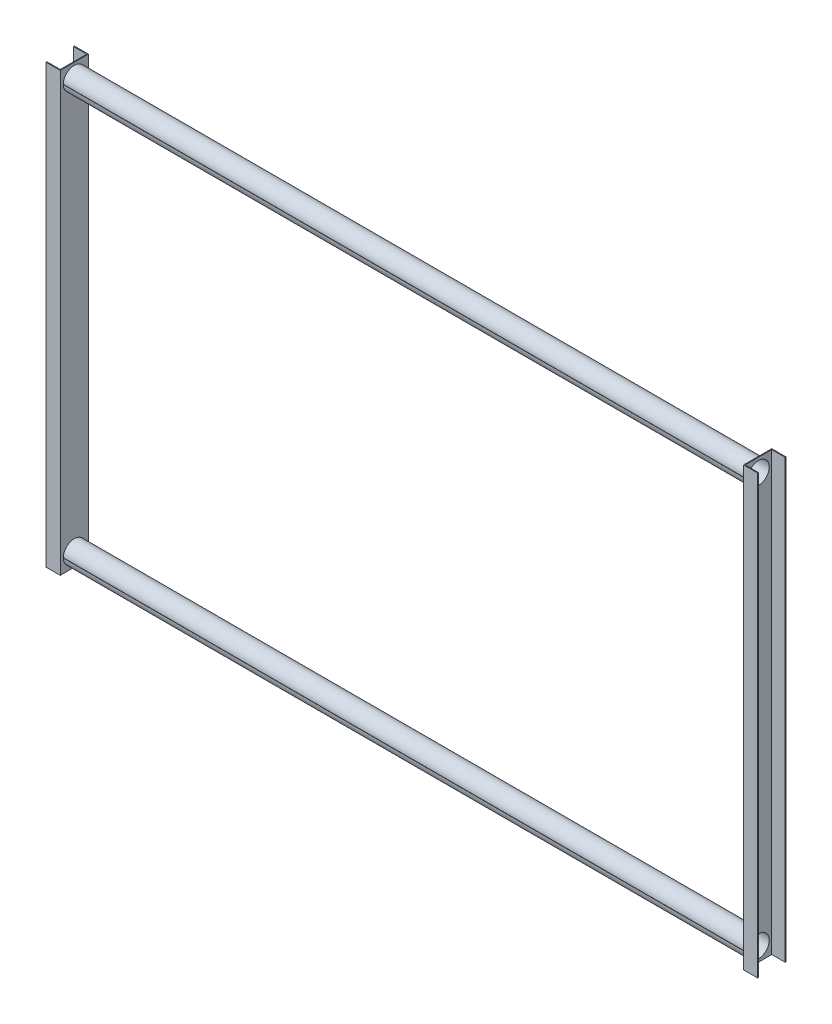
ISO-10303-21;
HEADER;
FILE_DESCRIPTION(('STEP AP214'),'2;1');
FILE_NAME('part.step','',(''),(''),'','','');
FILE_SCHEMA(('AUTOMOTIVE_DESIGN { 1 0 10303 214 1 1 1 1 }'));
ENDSEC;
DATA;
#1=APPLICATION_CONTEXT('core data for automotive mechanical design processes');
#2=APPLICATION_PROTOCOL_DEFINITION('international standard','automotive_design',2000,#1);
#3=PRODUCT_CONTEXT('',#1,'mechanical');
#4=PRODUCT('Part','Part','',(#3));
#5=PRODUCT_RELATED_PRODUCT_CATEGORY('part','',(#4));
#6=PRODUCT_DEFINITION_FORMATION('','',#4);
#7=PRODUCT_DEFINITION_CONTEXT('part definition',#1,'design');
#8=PRODUCT_DEFINITION('design','',#6,#7);
#9=PRODUCT_DEFINITION_SHAPE('','',#8);
#10=(LENGTH_UNIT() NAMED_UNIT(*) SI_UNIT(.MILLI.,.METRE.));
#11=(NAMED_UNIT(*) PLANE_ANGLE_UNIT() SI_UNIT($,.RADIAN.));
#12=(NAMED_UNIT(*) SI_UNIT($,.STERADIAN.) SOLID_ANGLE_UNIT());
#13=UNCERTAINTY_MEASURE_WITH_UNIT(LENGTH_MEASURE(1.E-05),#10,'distance_accuracy_value','');
#14=(GEOMETRIC_REPRESENTATION_CONTEXT(3) GLOBAL_UNCERTAINTY_ASSIGNED_CONTEXT((#13)) GLOBAL_UNIT_ASSIGNED_CONTEXT((#10,
#11,#12)) REPRESENTATION_CONTEXT('',''));
#15=CARTESIAN_POINT('',(0.,0.,0.));
#16=DIRECTION('',(0.,0.,1.));
#17=DIRECTION('',(1.,0.,0.));
#18=AXIS2_PLACEMENT_3D('',#15,#16,#17);
#19=CARTESIAN_POINT('',(0.,1600.,-51.5));
#20=DIRECTION('',(-1.,0.,0.));
#21=DIRECTION('',(0.,0.,1.));
#22=AXIS2_PLACEMENT_3D('',#19,#20,#21);
#23=PLANE('',#22);
#24=DIRECTION('',(0.,0.,1.));
#25=VECTOR('',#24,1.);
#26=CARTESIAN_POINT('',(0.,49.5000000000005,39.4968353162626));
#27=LINE('',#26,#25);
#28=CARTESIAN_POINT('',(0.,49.5000000000005,39.4968353162626));
#29=VERTEX_POINT('',#28);
#30=CARTESIAN_POINT('',(0.,49.5000000000005,40.4969134626327));
#31=VERTEX_POINT('',#30);
#32=EDGE_CURVE('E338',#29,#31,#27,.T.);
#33=ORIENTED_EDGE('',*,*,#32,.F.);
#34=CARTESIAN_POINT('',(0.,50.0000000000005,-4.44089209850063E-13));
#35=DIRECTION('',(-1.,0.,0.));
#36=DIRECTION('',(0.,0.,1.));
#37=AXIS2_PLACEMENT_3D('',#34,#35,#36);
#38=CIRCLE('',#37,39.5);
#39=CARTESIAN_POINT('',(0.,50.5000000000005,39.4968353162626));
#40=VERTEX_POINT('',#39);
#41=EDGE_CURVE('E373',#29,#40,#38,.T.);
#42=ORIENTED_EDGE('',*,*,#41,.T.);
#43=DIRECTION('',(0.,0.,-1.));
#44=VECTOR('',#43,1.);
#45=CARTESIAN_POINT('',(0.,50.5000000000005,39.4968353162626));
#46=LINE('',#45,#44);
#47=CARTESIAN_POINT('',(0.,50.5000000000005,40.4969134626327));
#48=VERTEX_POINT('',#47);
#49=EDGE_CURVE('E350',#48,#40,#46,.T.);
#50=ORIENTED_EDGE('',*,*,#49,.F.);
#51=CARTESIAN_POINT('',(0.,50.0000000000005,-4.44089209850063E-13));
#52=DIRECTION('',(1.,0.,0.));
#53=DIRECTION('',(0.,0.,-1.));
#54=AXIS2_PLACEMENT_3D('',#51,#52,#53);
#55=CIRCLE('',#54,40.5);
#56=EDGE_CURVE('E329',#31,#48,#55,.T.);
#57=ORIENTED_EDGE('',*,*,#56,.F.);
#58=EDGE_LOOP('',(#33,#42,#50,#57));
#59=FACE_BOUND('',#58,.T.);
#60=DIRECTION('',(0.,0.,-1.));
#61=VECTOR('',#60,1.);
#62=CARTESIAN_POINT('',(0.,0.,-51.5));
#63=LINE('',#62,#61);
#64=CARTESIAN_POINT('',(0.,0.,51.5));
#65=VERTEX_POINT('',#64);
#66=CARTESIAN_POINT('',(0.,0.,-51.5));
#67=VERTEX_POINT('',#66);
#68=EDGE_CURVE('E416',#65,#67,#63,.T.);
#69=ORIENTED_EDGE('',*,*,#68,.T.);
#70=DIRECTION('',(0.,-1.,0.));
#71=VECTOR('',#70,1.);
#72=CARTESIAN_POINT('',(0.,1600.,-51.5));
#73=LINE('',#72,#71);
#74=CARTESIAN_POINT('',(0.,1600.,-51.5));
#75=VERTEX_POINT('',#74);
#76=EDGE_CURVE('E445',#75,#67,#73,.T.);
#77=ORIENTED_EDGE('',*,*,#76,.F.);
#78=DIRECTION('',(0.,0.,-1.));
#79=VECTOR('',#78,1.);
#80=CARTESIAN_POINT('',(0.,1600.,-51.5));
#81=LINE('',#80,#79);
#82=CARTESIAN_POINT('',(0.,1600.,51.5));
#83=VERTEX_POINT('',#82);
#84=EDGE_CURVE('E391',#83,#75,#81,.T.);
#85=ORIENTED_EDGE('',*,*,#84,.F.);
#86=DIRECTION('',(0.,-1.,0.));
#87=VECTOR('',#86,1.);
#88=CARTESIAN_POINT('',(0.,1600.,51.5));
#89=LINE('',#88,#87);
#90=EDGE_CURVE('E449',#83,#65,#89,.T.);
#91=ORIENTED_EDGE('',*,*,#90,.T.);
#92=EDGE_LOOP('',(#69,#77,#85,#91));
#93=FACE_BOUND('',#92,.T.);
#94=DIRECTION('',(0.,0.,-1.));
#95=VECTOR('',#94,1.);
#96=CARTESIAN_POINT('',(0.,1550.5,39.496835316263));
#97=LINE('',#96,#95);
#98=CARTESIAN_POINT('',(0.,1550.5,40.4969134626332));
#99=VERTEX_POINT('',#98);
#100=CARTESIAN_POINT('',(0.,1550.5,39.496835316263));
#101=VERTEX_POINT('',#100);
#102=EDGE_CURVE('E59',#99,#101,#97,.T.);
#103=ORIENTED_EDGE('',*,*,#102,.F.);
#104=CARTESIAN_POINT('',(0.,1550.,0.));
#105=DIRECTION('',(1.,0.,0.));
#106=DIRECTION('',(0.,0.,-1.));
#107=AXIS2_PLACEMENT_3D('',#104,#105,#106);
#108=CIRCLE('',#107,40.5);
#109=CARTESIAN_POINT('',(0.,1549.5,40.4969134626332));
#110=VERTEX_POINT('',#109);
#111=EDGE_CURVE('E64',#110,#99,#108,.T.);
#112=ORIENTED_EDGE('',*,*,#111,.F.);
#113=DIRECTION('',(0.,0.,1.));
#114=VECTOR('',#113,1.);
#115=CARTESIAN_POINT('',(0.,1549.5,39.496835316263));
#116=LINE('',#115,#114);
#117=CARTESIAN_POINT('',(0.,1549.5,39.496835316263));
#118=VERTEX_POINT('',#117);
#119=EDGE_CURVE('E704',#118,#110,#116,.T.);
#120=ORIENTED_EDGE('',*,*,#119,.F.);
#121=CARTESIAN_POINT('',(0.,1550.,0.));
#122=DIRECTION('',(-1.,0.,0.));
#123=DIRECTION('',(0.,0.,1.));
#124=AXIS2_PLACEMENT_3D('',#121,#122,#123);
#125=CIRCLE('',#124,39.5);
#126=EDGE_CURVE('E376',#118,#101,#125,.T.);
#127=ORIENTED_EDGE('',*,*,#126,.T.);
#128=EDGE_LOOP('',(#103,#112,#120,#127));
#129=FACE_BOUND('',#128,.T.);
#130=ADVANCED_FACE('F41',(#59,#93,#129),#23,.F.);
#131=CARTESIAN_POINT('',(2500.,1600.,-51.5000000000003));
#132=DIRECTION('',(1.,0.,0.));
#133=DIRECTION('',(0.,0.,-1.));
#134=AXIS2_PLACEMENT_3D('',#131,#132,#133);
#135=PLANE('',#134);
#136=CARTESIAN_POINT('',(2500.,50.0000000000005,-1.20949345931716E-12));
#137=DIRECTION('',(1.,0.,0.));
#138=DIRECTION('',(0.,0.,-1.));
#139=AXIS2_PLACEMENT_3D('',#136,#137,#138);
#140=CIRCLE('',#139,40.5);
#141=CARTESIAN_POINT('',(2500.,49.5000000000005,40.496913462632));
#142=VERTEX_POINT('',#141);
#143=CARTESIAN_POINT('',(2500.,50.5000000000005,40.496913462632));
#144=VERTEX_POINT('',#143);
#145=EDGE_CURVE('E333',#142,#144,#140,.T.);
#146=ORIENTED_EDGE('',*,*,#145,.T.);
#147=DIRECTION('',(0.,0.,-1.));
#148=VECTOR('',#147,1.);
#149=CARTESIAN_POINT('',(2500.,50.5000000000005,39.4968353162618));
#150=LINE('',#149,#148);
#151=CARTESIAN_POINT('',(2500.,50.5000000000005,39.4968353162618));
#152=VERTEX_POINT('',#151);
#153=EDGE_CURVE('E337',#144,#152,#150,.T.);
#154=ORIENTED_EDGE('',*,*,#153,.T.);
#155=CARTESIAN_POINT('',(2500.,50.0000000000005,-1.20949345931716E-12));
#156=DIRECTION('',(1.,0.,0.));
#157=DIRECTION('',(0.,0.,-1.));
#158=AXIS2_PLACEMENT_3D('',#155,#156,#157);
#159=CIRCLE('',#158,39.5);
#160=CARTESIAN_POINT('',(2500.,49.5000000000005,39.4968353162618));
#161=VERTEX_POINT('',#160);
#162=EDGE_CURVE('E235',#152,#161,#159,.T.);
#163=ORIENTED_EDGE('',*,*,#162,.T.);
#164=DIRECTION('',(0.,0.,1.));
#165=VECTOR('',#164,1.);
#166=CARTESIAN_POINT('',(2500.,49.5000000000005,39.4968353162618));
#167=LINE('',#166,#165);
#168=EDGE_CURVE('E342',#161,#142,#167,.T.);
#169=ORIENTED_EDGE('',*,*,#168,.T.);
#170=EDGE_LOOP('',(#146,#154,#163,#169));
#171=FACE_BOUND('',#170,.T.);
#172=DIRECTION('',(0.,0.,1.));
#173=VECTOR('',#172,1.);
#174=CARTESIAN_POINT('',(2500.,0.,-51.5000000000003));
#175=LINE('',#174,#173);
#176=CARTESIAN_POINT('',(2500.,0.,-51.5000000000003));
#177=VERTEX_POINT('',#176);
#178=CARTESIAN_POINT('',(2500.,0.,51.4999999999988));
#179=VERTEX_POINT('',#178);
#180=EDGE_CURVE('E287',#177,#179,#175,.T.);
#181=ORIENTED_EDGE('',*,*,#180,.T.);
#182=DIRECTION('',(0.,-1.,0.));
#183=VECTOR('',#182,1.);
#184=CARTESIAN_POINT('',(2500.,1600.,51.4999999999988));
#185=LINE('',#184,#183);
#186=CARTESIAN_POINT('',(2500.,1600.,51.4999999999988));
#187=VERTEX_POINT('',#186);
#188=EDGE_CURVE('E309',#187,#179,#185,.T.);
#189=ORIENTED_EDGE('',*,*,#188,.F.);
#190=DIRECTION('',(0.,0.,1.));
#191=VECTOR('',#190,1.);
#192=CARTESIAN_POINT('',(2500.,1600.,-51.5000000000003));
#193=LINE('',#192,#191);
#194=CARTESIAN_POINT('',(2500.,1600.,-51.5000000000003));
#195=VERTEX_POINT('',#194);
#196=EDGE_CURVE('E262',#195,#187,#193,.T.);
#197=ORIENTED_EDGE('',*,*,#196,.F.);
#198=DIRECTION('',(0.,-1.,0.));
#199=VECTOR('',#198,1.);
#200=CARTESIAN_POINT('',(2500.,1600.,-51.5000000000003));
#201=LINE('',#200,#199);
#202=EDGE_CURVE('E313',#195,#177,#201,.T.);
#203=ORIENTED_EDGE('',*,*,#202,.T.);
#204=EDGE_LOOP('',(#181,#189,#197,#203));
#205=FACE_BOUND('',#204,.T.);
#206=DIRECTION('',(0.,0.,-1.));
#207=VECTOR('',#206,1.);
#208=CARTESIAN_POINT('',(2500.,1550.5,39.4968353162622));
#209=LINE('',#208,#207);
#210=CARTESIAN_POINT('',(2500.,1550.5,40.4969134626324));
#211=VERTEX_POINT('',#210);
#212=CARTESIAN_POINT('',(2500.,1550.5,39.4968353162622));
#213=VERTEX_POINT('',#212);
#214=EDGE_CURVE('E220',#211,#213,#209,.T.);
#215=ORIENTED_EDGE('',*,*,#214,.T.);
#216=CARTESIAN_POINT('',(2500.,1550.,-7.65404249467096E-13));
#217=DIRECTION('',(1.,0.,0.));
#218=DIRECTION('',(0.,0.,-1.));
#219=AXIS2_PLACEMENT_3D('',#216,#217,#218);
#220=CIRCLE('',#219,39.5);
#221=CARTESIAN_POINT('',(2500.,1549.5,39.4968353162622));
#222=VERTEX_POINT('',#221);
#223=EDGE_CURVE('E205',#213,#222,#220,.T.);
#224=ORIENTED_EDGE('',*,*,#223,.T.);
#225=DIRECTION('',(0.,0.,1.));
#226=VECTOR('',#225,1.);
#227=CARTESIAN_POINT('',(2500.,1549.5,39.4968353162622));
#228=LINE('',#227,#226);
#229=CARTESIAN_POINT('',(2500.,1549.5,40.4969134626332));
#230=VERTEX_POINT('',#229);
#231=EDGE_CURVE('E227',#222,#230,#228,.T.);
#232=ORIENTED_EDGE('',*,*,#231,.T.);
#233=CARTESIAN_POINT('',(2500.,1550.,-7.65404249467096E-13));
#234=DIRECTION('',(1.,0.,0.));
#235=DIRECTION('',(0.,0.,-1.));
#236=AXIS2_PLACEMENT_3D('',#233,#234,#235);
#237=CIRCLE('',#236,40.5);
#238=EDGE_CURVE('E223',#230,#211,#237,.T.);
#239=ORIENTED_EDGE('',*,*,#238,.T.);
#240=EDGE_LOOP('',(#215,#224,#232,#239));
#241=FACE_BOUND('',#240,.T.);
#242=ADVANCED_FACE('F221',(#171,#205,#241),#135,.F.);
#243=CARTESIAN_POINT('',(-51.5,1600.,48.5));
#244=DIRECTION('',(0.,0.,1.));
#245=DIRECTION('',(1.,0.,0.));
#246=AXIS2_PLACEMENT_3D('',#243,#244,#245);
#247=PLANE('',#246);
#248=DIRECTION('',(-1.,0.,0.));
#249=VECTOR('',#248,1.);
#250=CARTESIAN_POINT('',(-51.5,0.,48.5));
#251=LINE('',#250,#249);
#252=CARTESIAN_POINT('',(-2.99999999999999,0.,48.5));
#253=VERTEX_POINT('',#252);
#254=CARTESIAN_POINT('',(-51.5,0.,48.5));
#255=VERTEX_POINT('',#254);
#256=EDGE_CURVE('E379',#253,#255,#251,.T.);
#257=ORIENTED_EDGE('',*,*,#256,.T.);
#258=DIRECTION('',(0.,-1.,0.));
#259=VECTOR('',#258,1.);
#260=CARTESIAN_POINT('',(-51.5,1600.,48.5));
#261=LINE('',#260,#259);
#262=CARTESIAN_POINT('',(-51.5,1600.,48.5));
#263=VERTEX_POINT('',#262);
#264=EDGE_CURVE('E11',#263,#255,#261,.T.);
#265=ORIENTED_EDGE('',*,*,#264,.F.);
#266=DIRECTION('',(-1.,0.,0.));
#267=VECTOR('',#266,1.);
#268=CARTESIAN_POINT('',(-51.5,1600.,48.5));
#269=LINE('',#268,#267);
#270=CARTESIAN_POINT('',(-2.99999999999999,1600.,48.5));
#271=VERTEX_POINT('',#270);
#272=EDGE_CURVE('E380',#271,#263,#269,.T.);
#273=ORIENTED_EDGE('',*,*,#272,.F.);
#274=DIRECTION('',(0.,-1.,0.));
#275=VECTOR('',#274,1.);
#276=CARTESIAN_POINT('',(-2.99999999999999,1600.,48.5));
#277=LINE('',#276,#275);
#278=EDGE_CURVE('E406',#271,#253,#277,.T.);
#279=ORIENTED_EDGE('',*,*,#278,.T.);
#280=EDGE_LOOP('',(#257,#265,#273,#279));
#281=FACE_BOUND('',#280,.T.);
#282=ADVANCED_FACE('F43',(#281),#247,.F.);
#283=CARTESIAN_POINT('',(-51.5,1600.,51.5));
#284=DIRECTION('',(1.,0.,0.));
#285=DIRECTION('',(0.,0.,-1.));
#286=AXIS2_PLACEMENT_3D('',#283,#284,#285);
#287=PLANE('',#286);
#288=DIRECTION('',(0.,0.,1.));
#289=VECTOR('',#288,1.);
#290=CARTESIAN_POINT('',(-51.5,0.,51.5));
#291=LINE('',#290,#289);
#292=CARTESIAN_POINT('',(-51.5,0.,51.5));
#293=VERTEX_POINT('',#292);
#294=EDGE_CURVE('E410',#255,#293,#291,.T.);
#295=ORIENTED_EDGE('',*,*,#294,.T.);
#296=DIRECTION('',(0.,-1.,0.));
#297=VECTOR('',#296,1.);
#298=CARTESIAN_POINT('',(-51.5,1600.,51.5));
#299=LINE('',#298,#297);
#300=CARTESIAN_POINT('',(-51.5,1600.,51.5));
#301=VERTEX_POINT('',#300);
#302=EDGE_CURVE('E51',#301,#293,#299,.T.);
#303=ORIENTED_EDGE('',*,*,#302,.F.);
#304=DIRECTION('',(0.,0.,1.));
#305=VECTOR('',#304,1.);
#306=CARTESIAN_POINT('',(-51.5,1600.,51.5));
#307=LINE('',#306,#305);
#308=EDGE_CURVE('E384',#263,#301,#307,.T.);
#309=ORIENTED_EDGE('',*,*,#308,.F.);
#310=ORIENTED_EDGE('',*,*,#264,.T.);
#311=EDGE_LOOP('',(#295,#303,#309,#310));
#312=FACE_BOUND('',#311,.T.);
#313=ADVANCED_FACE('F539',(#312),#287,.F.);
#314=CARTESIAN_POINT('',(0.,1600.,51.5));
#315=DIRECTION('',(0.,0.,-1.));
#316=DIRECTION('',(-1.,0.,0.));
#317=AXIS2_PLACEMENT_3D('',#314,#315,#316);
#318=PLANE('',#317);
#319=DIRECTION('',(1.,0.,0.));
#320=VECTOR('',#319,1.);
#321=CARTESIAN_POINT('',(0.,0.,51.5));
#322=LINE('',#321,#320);
#323=EDGE_CURVE('E413',#293,#65,#322,.T.);
#324=ORIENTED_EDGE('',*,*,#323,.T.);
#325=ORIENTED_EDGE('',*,*,#90,.F.);
#326=DIRECTION('',(1.,0.,0.));
#327=VECTOR('',#326,1.);
#328=CARTESIAN_POINT('',(0.,1600.,51.5));
#329=LINE('',#328,#327);
#330=EDGE_CURVE('E388',#301,#83,#329,.T.);
#331=ORIENTED_EDGE('',*,*,#330,.F.);
#332=ORIENTED_EDGE('',*,*,#302,.T.);
#333=EDGE_LOOP('',(#324,#325,#331,#332));
#334=FACE_BOUND('',#333,.T.);
#335=ADVANCED_FACE('F537',(#334),#318,.F.);
#336=CARTESIAN_POINT('',(-51.5,1600.,-51.5));
#337=DIRECTION('',(0.,0.,1.));
#338=DIRECTION('',(1.,0.,0.));
#339=AXIS2_PLACEMENT_3D('',#336,#337,#338);
#340=PLANE('',#339);
#341=DIRECTION('',(-1.,0.,0.));
#342=VECTOR('',#341,1.);
#343=CARTESIAN_POINT('',(-51.5,0.,-51.5));
#344=LINE('',#343,#342);
#345=CARTESIAN_POINT('',(-51.5,0.,-51.5));
#346=VERTEX_POINT('',#345);
#347=EDGE_CURVE('E419',#67,#346,#344,.T.);
#348=ORIENTED_EDGE('',*,*,#347,.T.);
#349=DIRECTION('',(0.,-1.,0.));
#350=VECTOR('',#349,1.);
#351=CARTESIAN_POINT('',(-51.5,1600.,-51.5));
#352=LINE('',#351,#350);
#353=CARTESIAN_POINT('',(-51.5,1600.,-51.5));
#354=VERTEX_POINT('',#353);
#355=EDGE_CURVE('E441',#354,#346,#352,.T.);
#356=ORIENTED_EDGE('',*,*,#355,.F.);
#357=DIRECTION('',(-1.,0.,0.));
#358=VECTOR('',#357,1.);
#359=CARTESIAN_POINT('',(-51.5,1600.,-51.5));
#360=LINE('',#359,#358);
#361=EDGE_CURVE('E394',#75,#354,#360,.T.);
#362=ORIENTED_EDGE('',*,*,#361,.F.);
#363=ORIENTED_EDGE('',*,*,#76,.T.);
#364=EDGE_LOOP('',(#348,#356,#362,#363));
#365=FACE_BOUND('',#364,.T.);
#366=ADVANCED_FACE('F535',(#365),#340,.F.);
#367=CARTESIAN_POINT('',(-51.5,1600.,-48.5));
#368=DIRECTION('',(1.,0.,0.));
#369=DIRECTION('',(0.,0.,-1.));
#370=AXIS2_PLACEMENT_3D('',#367,#368,#369);
#371=PLANE('',#370);
#372=DIRECTION('',(0.,0.,1.));
#373=VECTOR('',#372,1.);
#374=CARTESIAN_POINT('',(-51.5,0.,-48.5));
#375=LINE('',#374,#373);
#376=CARTESIAN_POINT('',(-51.5,0.,-48.5));
#377=VERTEX_POINT('',#376);
#378=EDGE_CURVE('E422',#346,#377,#375,.T.);
#379=ORIENTED_EDGE('',*,*,#378,.T.);
#380=DIRECTION('',(0.,-1.,0.));
#381=VECTOR('',#380,1.);
#382=CARTESIAN_POINT('',(-51.5,1600.,-48.5));
#383=LINE('',#382,#381);
#384=CARTESIAN_POINT('',(-51.5,1600.,-48.5));
#385=VERTEX_POINT('',#384);
#386=EDGE_CURVE('E437',#385,#377,#383,.T.);
#387=ORIENTED_EDGE('',*,*,#386,.F.);
#388=DIRECTION('',(0.,0.,1.));
#389=VECTOR('',#388,1.);
#390=CARTESIAN_POINT('',(-51.5,1600.,-48.5));
#391=LINE('',#390,#389);
#392=EDGE_CURVE('E397',#354,#385,#391,.T.);
#393=ORIENTED_EDGE('',*,*,#392,.F.);
#394=ORIENTED_EDGE('',*,*,#355,.T.);
#395=EDGE_LOOP('',(#379,#387,#393,#394));
#396=FACE_BOUND('',#395,.T.);
#397=ADVANCED_FACE('F576',(#396),#371,.F.);
#398=CARTESIAN_POINT('',(-2.99999999999999,1600.,-48.5));
#399=DIRECTION('',(0.,0.,-1.));
#400=DIRECTION('',(-1.,0.,0.));
#401=AXIS2_PLACEMENT_3D('',#398,#399,#400);
#402=PLANE('',#401);
#403=DIRECTION('',(1.,0.,0.));
#404=VECTOR('',#403,1.);
#405=CARTESIAN_POINT('',(-2.99999999999999,0.,-48.5));
#406=LINE('',#405,#404);
#407=CARTESIAN_POINT('',(-2.99999999999999,0.,-48.5));
#408=VERTEX_POINT('',#407);
#409=EDGE_CURVE('E425',#377,#408,#406,.T.);
#410=ORIENTED_EDGE('',*,*,#409,.T.);
#411=DIRECTION('',(0.,-1.,0.));
#412=VECTOR('',#411,1.);
#413=CARTESIAN_POINT('',(-2.99999999999999,1600.,-48.5));
#414=LINE('',#413,#412);
#415=CARTESIAN_POINT('',(-2.99999999999999,1600.,-48.5));
#416=VERTEX_POINT('',#415);
#417=EDGE_CURVE('E433',#416,#408,#414,.T.);
#418=ORIENTED_EDGE('',*,*,#417,.F.);
#419=DIRECTION('',(1.,0.,0.));
#420=VECTOR('',#419,1.);
#421=CARTESIAN_POINT('',(-2.99999999999999,1600.,-48.5));
#422=LINE('',#421,#420);
#423=EDGE_CURVE('E400',#385,#416,#422,.T.);
#424=ORIENTED_EDGE('',*,*,#423,.F.);
#425=ORIENTED_EDGE('',*,*,#386,.T.);
#426=EDGE_LOOP('',(#410,#418,#424,#425));
#427=FACE_BOUND('',#426,.T.);
#428=ADVANCED_FACE('F574',(#427),#402,.F.);
#429=CARTESIAN_POINT('',(-2.99999999999999,1600.,48.5));
#430=DIRECTION('',(1.,0.,0.));
#431=DIRECTION('',(0.,0.,-1.));
#432=AXIS2_PLACEMENT_3D('',#429,#430,#431);
#433=PLANE('',#432);
#434=CARTESIAN_POINT('',(-2.99999999999999,1550.,0.));
#435=DIRECTION('',(1.,0.,0.));
#436=DIRECTION('',(0.,0.,-1.));
#437=AXIS2_PLACEMENT_3D('',#434,#435,#436);
#438=CIRCLE('',#437,39.5);
#439=CARTESIAN_POINT('',(-2.99999999999999,1550.,-39.5));
#440=VERTEX_POINT('',#439);
#441=EDGE_CURVE('E45',#440,#440,#438,.T.);
#442=ORIENTED_EDGE('',*,*,#441,.T.);
#443=EDGE_LOOP('',(#442));
#444=FACE_BOUND('',#443,.T.);
#445=CARTESIAN_POINT('',(-2.99999999999999,50.0000000000005,-4.43170724750702E-13));
#446=DIRECTION('',(1.,0.,0.));
#447=DIRECTION('',(0.,0.,-1.));
#448=AXIS2_PLACEMENT_3D('',#445,#446,#447);
#449=CIRCLE('',#448,39.5);
#450=CARTESIAN_POINT('',(-2.99999999999999,50.0000000000005,-39.5000000000004));
#451=VERTEX_POINT('',#450);
#452=EDGE_CURVE('E372',#451,#451,#449,.T.);
#453=ORIENTED_EDGE('',*,*,#452,.T.);
#454=EDGE_LOOP('',(#453));
#455=FACE_BOUND('',#454,.T.);
#456=DIRECTION('',(0.,0.,1.));
#457=VECTOR('',#456,1.);
#458=CARTESIAN_POINT('',(-2.99999999999999,0.,48.5));
#459=LINE('',#458,#457);
#460=EDGE_CURVE('E385',#408,#253,#459,.T.);
#461=ORIENTED_EDGE('',*,*,#460,.T.);
#462=ORIENTED_EDGE('',*,*,#278,.F.);
#463=DIRECTION('',(0.,0.,1.));
#464=VECTOR('',#463,1.);
#465=CARTESIAN_POINT('',(-2.99999999999999,1600.,48.5));
#466=LINE('',#465,#464);
#467=EDGE_CURVE('E403',#416,#271,#466,.T.);
#468=ORIENTED_EDGE('',*,*,#467,.F.);
#469=ORIENTED_EDGE('',*,*,#417,.T.);
#470=EDGE_LOOP('',(#461,#462,#468,#469));
#471=FACE_BOUND('',#470,.T.);
#472=ADVANCED_FACE('F459',(#444,#455,#471),#433,.F.);
#473=CARTESIAN_POINT('',(0.,1600.,0.));
#474=DIRECTION('',(0.,1.,0.));
#475=DIRECTION('',(0.,0.,1.));
#476=AXIS2_PLACEMENT_3D('',#473,#474,#475);
#477=PLANE('',#476);
#478=ORIENTED_EDGE('',*,*,#272,.T.);
#479=ORIENTED_EDGE('',*,*,#308,.T.);
#480=ORIENTED_EDGE('',*,*,#330,.T.);
#481=ORIENTED_EDGE('',*,*,#84,.T.);
#482=ORIENTED_EDGE('',*,*,#361,.T.);
#483=ORIENTED_EDGE('',*,*,#392,.T.);
#484=ORIENTED_EDGE('',*,*,#423,.T.);
#485=ORIENTED_EDGE('',*,*,#467,.T.);
#486=EDGE_LOOP('',(#478,#479,#480,#481,#482,#483,#484,#485));
#487=FACE_BOUND('',#486,.T.);
#488=ADVANCED_FACE('F564',(#487),#477,.T.);
#489=CARTESIAN_POINT('',(0.,0.,0.));
#490=DIRECTION('',(0.,1.,0.));
#491=DIRECTION('',(0.,0.,1.));
#492=AXIS2_PLACEMENT_3D('',#489,#490,#491);
#493=PLANE('',#492);
#494=ORIENTED_EDGE('',*,*,#256,.F.);
#495=ORIENTED_EDGE('',*,*,#460,.F.);
#496=ORIENTED_EDGE('',*,*,#409,.F.);
#497=ORIENTED_EDGE('',*,*,#378,.F.);
#498=ORIENTED_EDGE('',*,*,#347,.F.);
#499=ORIENTED_EDGE('',*,*,#68,.F.);
#500=ORIENTED_EDGE('',*,*,#323,.F.);
#501=ORIENTED_EDGE('',*,*,#294,.F.);
#502=EDGE_LOOP('',(#494,#495,#496,#497,#498,#499,#500,#501));
#503=FACE_BOUND('',#502,.T.);
#504=ADVANCED_FACE('F465',(#503),#493,.F.);
#505=CARTESIAN_POINT('',(-51.5,50.0000000000005,-4.2832188231104E-13));
#506=DIRECTION('',(1.,0.,0.));
#507=DIRECTION('',(0.,0.,-1.));
#508=AXIS2_PLACEMENT_3D('',#505,#506,#507);
#509=CYLINDRICAL_SURFACE('',#508,39.5);
#510=ORIENTED_EDGE('',*,*,#452,.F.);
#511=EDGE_LOOP('',(#510));
#512=FACE_BOUND('',#511,.T.);
#513=ORIENTED_EDGE('',*,*,#41,.F.);
#514=DIRECTION('',(-1.,0.,0.));
#515=VECTOR('',#514,1.);
#516=CARTESIAN_POINT('',(2500.,49.5000000000005,39.4968353162618));
#517=LINE('',#516,#515);
#518=EDGE_CURVE('E360',#161,#29,#517,.T.);
#519=ORIENTED_EDGE('',*,*,#518,.F.);
#520=ORIENTED_EDGE('',*,*,#162,.F.);
#521=DIRECTION('',(-1.,0.,0.));
#522=VECTOR('',#521,1.);
#523=CARTESIAN_POINT('',(2500.,50.5000000000005,39.4968353162618));
#524=LINE('',#523,#522);
#525=EDGE_CURVE('E364',#152,#40,#524,.T.);
#526=ORIENTED_EDGE('',*,*,#525,.T.);
#527=EDGE_LOOP('',(#513,#519,#520,#526));
#528=FACE_BOUND('',#527,.T.);
#529=CARTESIAN_POINT('',(2503.,50.0000000000005,-1.21041194441652E-12));
#530=DIRECTION('',(-1.,0.,0.));
#531=DIRECTION('',(0.,0.,1.));
#532=AXIS2_PLACEMENT_3D('',#529,#530,#531);
#533=CIRCLE('',#532,39.5);
#534=CARTESIAN_POINT('',(2503.,50.0000000000005,39.4999999999988));
#535=VERTEX_POINT('',#534);
#536=EDGE_CURVE('E217',#535,#535,#533,.T.);
#537=ORIENTED_EDGE('',*,*,#536,.F.);
#538=EDGE_LOOP('',(#537));
#539=FACE_BOUND('',#538,.T.);
#540=ADVANCED_FACE('F462',(#512,#528,#539),#509,.F.);
#541=CARTESIAN_POINT('',(-51.5,1550.,0.));
#542=DIRECTION('',(1.,0.,0.));
#543=DIRECTION('',(0.,0.,-1.));
#544=AXIS2_PLACEMENT_3D('',#541,#542,#543);
#545=CYLINDRICAL_SURFACE('',#544,39.5);
#546=ORIENTED_EDGE('',*,*,#441,.F.);
#547=EDGE_LOOP('',(#546));
#548=FACE_BOUND('',#547,.T.);
#549=ORIENTED_EDGE('',*,*,#126,.F.);
#550=DIRECTION('',(-1.,0.,0.));
#551=VECTOR('',#550,1.);
#552=CARTESIAN_POINT('',(2500.,1549.5,39.4968353162622));
#553=LINE('',#552,#551);
#554=EDGE_CURVE('E212',#222,#118,#553,.T.);
#555=ORIENTED_EDGE('',*,*,#554,.F.);
#556=ORIENTED_EDGE('',*,*,#223,.F.);
#557=DIRECTION('',(-1.,0.,0.));
#558=VECTOR('',#557,1.);
#559=CARTESIAN_POINT('',(2500.,1550.5,39.4968353162622));
#560=LINE('',#559,#558);
#561=EDGE_CURVE('E210',#213,#101,#560,.T.);
#562=ORIENTED_EDGE('',*,*,#561,.T.);
#563=EDGE_LOOP('',(#549,#555,#556,#562));
#564=FACE_BOUND('',#563,.T.);
#565=CARTESIAN_POINT('',(2503.,1550.,-7.66322734566456E-13));
#566=DIRECTION('',(-1.,0.,0.));
#567=DIRECTION('',(0.,0.,1.));
#568=AXIS2_PLACEMENT_3D('',#565,#566,#567);
#569=CIRCLE('',#568,39.5);
#570=CARTESIAN_POINT('',(2503.,1550.,39.4999999999992));
#571=VERTEX_POINT('',#570);
#572=EDGE_CURVE('E216',#571,#571,#569,.T.);
#573=ORIENTED_EDGE('',*,*,#572,.F.);
#574=EDGE_LOOP('',(#573));
#575=FACE_BOUND('',#574,.T.);
#576=ADVANCED_FACE('F207',(#548,#564,#575),#545,.F.);
#577=CARTESIAN_POINT('',(2500.,50.0000000000005,-1.20949345931716E-12));
#578=DIRECTION('',(-1.,0.,0.));
#579=DIRECTION('',(0.,0.,1.));
#580=AXIS2_PLACEMENT_3D('',#577,#578,#579);
#581=CYLINDRICAL_SURFACE('',#580,40.5);
#582=ORIENTED_EDGE('',*,*,#56,.T.);
#583=DIRECTION('',(-1.,0.,0.));
#584=VECTOR('',#583,1.);
#585=CARTESIAN_POINT('',(2500.,50.5000000000005,40.496913462632));
#586=LINE('',#585,#584);
#587=EDGE_CURVE('E368',#144,#48,#586,.T.);
#588=ORIENTED_EDGE('',*,*,#587,.F.);
#589=ORIENTED_EDGE('',*,*,#145,.F.);
#590=DIRECTION('',(-1.,0.,0.));
#591=VECTOR('',#590,1.);
#592=CARTESIAN_POINT('',(2500.,49.5000000000005,40.496913462632));
#593=LINE('',#592,#591);
#594=EDGE_CURVE('E346',#142,#31,#593,.T.);
#595=ORIENTED_EDGE('',*,*,#594,.T.);
#596=EDGE_LOOP('',(#582,#588,#589,#595));
#597=FACE_BOUND('',#596,.T.);
#598=ADVANCED_FACE('F593',(#597),#581,.T.);
#599=CARTESIAN_POINT('',(2500.,50.5000000000005,39.4968353162618));
#600=DIRECTION('',(0.,1.,0.));
#601=DIRECTION('',(0.,0.,1.));
#602=AXIS2_PLACEMENT_3D('',#599,#600,#601);
#603=PLANE('',#602);
#604=ORIENTED_EDGE('',*,*,#49,.T.);
#605=ORIENTED_EDGE('',*,*,#525,.F.);
#606=ORIENTED_EDGE('',*,*,#153,.F.);
#607=ORIENTED_EDGE('',*,*,#587,.T.);
#608=EDGE_LOOP('',(#604,#605,#606,#607));
#609=FACE_BOUND('',#608,.T.);
#610=ADVANCED_FACE('F597',(#609),#603,.F.);
#611=CARTESIAN_POINT('',(2500.,49.5000000000005,39.4968353162618));
#612=DIRECTION('',(0.,-1.,0.));
#613=DIRECTION('',(0.,0.,-1.));
#614=AXIS2_PLACEMENT_3D('',#611,#612,#613);
#615=PLANE('',#614);
#616=ORIENTED_EDGE('',*,*,#32,.T.);
#617=ORIENTED_EDGE('',*,*,#594,.F.);
#618=ORIENTED_EDGE('',*,*,#168,.F.);
#619=ORIENTED_EDGE('',*,*,#518,.T.);
#620=EDGE_LOOP('',(#616,#617,#618,#619));
#621=FACE_BOUND('',#620,.T.);
#622=ADVANCED_FACE('F475',(#621),#615,.F.);
#623=CARTESIAN_POINT('',(2503.,1600.,48.4999999999997));
#624=DIRECTION('',(-1.,0.,0.));
#625=DIRECTION('',(0.,0.,1.));
#626=AXIS2_PLACEMENT_3D('',#623,#624,#625);
#627=PLANE('',#626);
#628=ORIENTED_EDGE('',*,*,#572,.T.);
#629=EDGE_LOOP('',(#628));
#630=FACE_BOUND('',#629,.T.);
#631=ORIENTED_EDGE('',*,*,#536,.T.);
#632=EDGE_LOOP('',(#631));
#633=FACE_BOUND('',#632,.T.);
#634=DIRECTION('',(0.,0.,-1.));
#635=VECTOR('',#634,1.);
#636=CARTESIAN_POINT('',(2503.,0.,48.4999999999997));
#637=LINE('',#636,#635);
#638=CARTESIAN_POINT('',(2503.,0.,48.4999999999997));
#639=VERTEX_POINT('',#638);
#640=CARTESIAN_POINT('',(2503.,0.,-48.5000000000003));
#641=VERTEX_POINT('',#640);
#642=EDGE_CURVE('E247',#639,#641,#637,.T.);
#643=ORIENTED_EDGE('',*,*,#642,.T.);
#644=DIRECTION('',(0.,-1.,0.));
#645=VECTOR('',#644,1.);
#646=CARTESIAN_POINT('',(2503.,1600.,-48.5000000000003));
#647=LINE('',#646,#645);
#648=CARTESIAN_POINT('',(2503.,1600.,-48.5000000000003));
#649=VERTEX_POINT('',#648);
#650=EDGE_CURVE('E325',#649,#641,#647,.T.);
#651=ORIENTED_EDGE('',*,*,#650,.F.);
#652=DIRECTION('',(0.,0.,-1.));
#653=VECTOR('',#652,1.);
#654=CARTESIAN_POINT('',(2503.,1600.,48.4999999999997));
#655=LINE('',#654,#653);
#656=CARTESIAN_POINT('',(2503.,1600.,48.4999999999997));
#657=VERTEX_POINT('',#656);
#658=EDGE_CURVE('E248',#657,#649,#655,.T.);
#659=ORIENTED_EDGE('',*,*,#658,.F.);
#660=DIRECTION('',(0.,-1.,0.));
#661=VECTOR('',#660,1.);
#662=CARTESIAN_POINT('',(2503.,1600.,48.4999999999997));
#663=LINE('',#662,#661);
#664=EDGE_CURVE('E274',#657,#639,#663,.T.);
#665=ORIENTED_EDGE('',*,*,#664,.T.);
#666=EDGE_LOOP('',(#643,#651,#659,#665));
#667=FACE_BOUND('',#666,.T.);
#668=ADVANCED_FACE('F471',(#630,#633,#667),#627,.F.);
#669=CARTESIAN_POINT('',(2503.,1600.,-48.5000000000003));
#670=DIRECTION('',(0.,0.,-1.));
#671=DIRECTION('',(-1.,0.,0.));
#672=AXIS2_PLACEMENT_3D('',#669,#670,#671);
#673=PLANE('',#672);
#674=DIRECTION('',(1.,0.,0.));
#675=VECTOR('',#674,1.);
#676=CARTESIAN_POINT('',(2503.,0.,-48.5000000000003));
#677=LINE('',#676,#675);
#678=CARTESIAN_POINT('',(2551.5,0.,-48.5000000000003));
#679=VERTEX_POINT('',#678);
#680=EDGE_CURVE('E278',#641,#679,#677,.T.);
#681=ORIENTED_EDGE('',*,*,#680,.T.);
#682=DIRECTION('',(0.,-1.,0.));
#683=VECTOR('',#682,1.);
#684=CARTESIAN_POINT('',(2551.5,1600.,-48.5000000000003));
#685=LINE('',#684,#683);
#686=CARTESIAN_POINT('',(2551.5,1600.,-48.5000000000003));
#687=VERTEX_POINT('',#686);
#688=EDGE_CURVE('E321',#687,#679,#685,.T.);
#689=ORIENTED_EDGE('',*,*,#688,.F.);
#690=DIRECTION('',(1.,0.,0.));
#691=VECTOR('',#690,1.);
#692=CARTESIAN_POINT('',(2503.,1600.,-48.5000000000003));
#693=LINE('',#692,#691);
#694=EDGE_CURVE('E252',#649,#687,#693,.T.);
#695=ORIENTED_EDGE('',*,*,#694,.F.);
#696=ORIENTED_EDGE('',*,*,#650,.T.);
#697=EDGE_LOOP('',(#681,#689,#695,#696));
#698=FACE_BOUND('',#697,.T.);
#699=ADVANCED_FACE('F474',(#698),#673,.F.);
#700=CARTESIAN_POINT('',(2551.5,1600.,-48.5000000000003));
#701=DIRECTION('',(-1.,0.,0.));
#702=DIRECTION('',(0.,0.,1.));
#703=AXIS2_PLACEMENT_3D('',#700,#701,#702);
#704=PLANE('',#703);
#705=DIRECTION('',(0.,0.,-1.));
#706=VECTOR('',#705,1.);
#707=CARTESIAN_POINT('',(2551.5,0.,-48.5000000000003));
#708=LINE('',#707,#706);
#709=CARTESIAN_POINT('',(2551.5,0.,-51.5000000000003));
#710=VERTEX_POINT('',#709);
#711=EDGE_CURVE('E281',#679,#710,#708,.T.);
#712=ORIENTED_EDGE('',*,*,#711,.T.);
#713=DIRECTION('',(0.,-1.,0.));
#714=VECTOR('',#713,1.);
#715=CARTESIAN_POINT('',(2551.5,1600.,-51.5000000000003));
#716=LINE('',#715,#714);
#717=CARTESIAN_POINT('',(2551.5,1600.,-51.5000000000003));
#718=VERTEX_POINT('',#717);
#719=EDGE_CURVE('E317',#718,#710,#716,.T.);
#720=ORIENTED_EDGE('',*,*,#719,.F.);
#721=DIRECTION('',(0.,0.,-1.));
#722=VECTOR('',#721,1.);
#723=CARTESIAN_POINT('',(2551.5,1600.,-48.5000000000003));
#724=LINE('',#723,#722);
#725=EDGE_CURVE('E256',#687,#718,#724,.T.);
#726=ORIENTED_EDGE('',*,*,#725,.F.);
#727=ORIENTED_EDGE('',*,*,#688,.T.);
#728=EDGE_LOOP('',(#712,#720,#726,#727));
#729=FACE_BOUND('',#728,.T.);
#730=ADVANCED_FACE('F515',(#729),#704,.F.);
#731=CARTESIAN_POINT('',(2551.5,1600.,-51.5000000000003));
#732=DIRECTION('',(0.,0.,1.));
#733=DIRECTION('',(1.,0.,0.));
#734=AXIS2_PLACEMENT_3D('',#731,#732,#733);
#735=PLANE('',#734);
#736=DIRECTION('',(-1.,0.,0.));
#737=VECTOR('',#736,1.);
#738=CARTESIAN_POINT('',(2551.5,0.,-51.5000000000003));
#739=LINE('',#738,#737);
#740=EDGE_CURVE('E284',#710,#177,#739,.T.);
#741=ORIENTED_EDGE('',*,*,#740,.T.);
#742=ORIENTED_EDGE('',*,*,#202,.F.);
#743=DIRECTION('',(-1.,0.,0.));
#744=VECTOR('',#743,1.);
#745=CARTESIAN_POINT('',(2551.5,1600.,-51.5000000000003));
#746=LINE('',#745,#744);
#747=EDGE_CURVE('E259',#718,#195,#746,.T.);
#748=ORIENTED_EDGE('',*,*,#747,.F.);
#749=ORIENTED_EDGE('',*,*,#719,.T.);
#750=EDGE_LOOP('',(#741,#742,#748,#749));
#751=FACE_BOUND('',#750,.T.);
#752=ADVANCED_FACE('F512',(#751),#735,.F.);
#753=CARTESIAN_POINT('',(2500.,1600.,51.4999999999988));
#754=DIRECTION('',(0.,0.,-1.));
#755=DIRECTION('',(-1.,0.,0.));
#756=AXIS2_PLACEMENT_3D('',#753,#754,#755);
#757=PLANE('',#756);
#758=DIRECTION('',(1.,0.,0.));
#759=VECTOR('',#758,1.);
#760=CARTESIAN_POINT('',(2500.,0.,51.4999999999988));
#761=LINE('',#760,#759);
#762=CARTESIAN_POINT('',(2551.5,0.,51.4999999999997));
#763=VERTEX_POINT('',#762);
#764=EDGE_CURVE('E290',#179,#763,#761,.T.);
#765=ORIENTED_EDGE('',*,*,#764,.T.);
#766=DIRECTION('',(0.,-1.,0.));
#767=VECTOR('',#766,1.);
#768=CARTESIAN_POINT('',(2551.5,1600.,51.4999999999997));
#769=LINE('',#768,#767);
#770=CARTESIAN_POINT('',(2551.5,1600.,51.4999999999997));
#771=VERTEX_POINT('',#770);
#772=EDGE_CURVE('E305',#771,#763,#769,.T.);
#773=ORIENTED_EDGE('',*,*,#772,.F.);
#774=DIRECTION('',(1.,0.,0.));
#775=VECTOR('',#774,1.);
#776=CARTESIAN_POINT('',(2500.,1600.,51.4999999999988));
#777=LINE('',#776,#775);
#778=EDGE_CURVE('E265',#187,#771,#777,.T.);
#779=ORIENTED_EDGE('',*,*,#778,.F.);
#780=ORIENTED_EDGE('',*,*,#188,.T.);
#781=EDGE_LOOP('',(#765,#773,#779,#780));
#782=FACE_BOUND('',#781,.T.);
#783=ADVANCED_FACE('F504',(#782),#757,.F.);
#784=CARTESIAN_POINT('',(2551.5,1600.,51.4999999999997));
#785=DIRECTION('',(-1.,0.,0.));
#786=DIRECTION('',(0.,0.,1.));
#787=AXIS2_PLACEMENT_3D('',#784,#785,#786);
#788=PLANE('',#787);
#789=DIRECTION('',(0.,0.,-1.));
#790=VECTOR('',#789,1.);
#791=CARTESIAN_POINT('',(2551.5,0.,51.4999999999997));
#792=LINE('',#791,#790);
#793=CARTESIAN_POINT('',(2551.5,0.,48.4999999999997));
#794=VERTEX_POINT('',#793);
#795=EDGE_CURVE('E293',#763,#794,#792,.T.);
#796=ORIENTED_EDGE('',*,*,#795,.T.);
#797=DIRECTION('',(0.,-1.,0.));
#798=VECTOR('',#797,1.);
#799=CARTESIAN_POINT('',(2551.5,1600.,48.4999999999997));
#800=LINE('',#799,#798);
#801=CARTESIAN_POINT('',(2551.5,1600.,48.4999999999997));
#802=VERTEX_POINT('',#801);
#803=EDGE_CURVE('E301',#802,#794,#800,.T.);
#804=ORIENTED_EDGE('',*,*,#803,.F.);
#805=DIRECTION('',(0.,0.,-1.));
#806=VECTOR('',#805,1.);
#807=CARTESIAN_POINT('',(2551.5,1600.,51.4999999999997));
#808=LINE('',#807,#806);
#809=EDGE_CURVE('E268',#771,#802,#808,.T.);
#810=ORIENTED_EDGE('',*,*,#809,.F.);
#811=ORIENTED_EDGE('',*,*,#772,.T.);
#812=EDGE_LOOP('',(#796,#804,#810,#811));
#813=FACE_BOUND('',#812,.T.);
#814=ADVANCED_FACE('F499',(#813),#788,.F.);
#815=CARTESIAN_POINT('',(2551.5,1600.,48.4999999999997));
#816=DIRECTION('',(0.,0.,1.));
#817=DIRECTION('',(1.,0.,0.));
#818=AXIS2_PLACEMENT_3D('',#815,#816,#817);
#819=PLANE('',#818);
#820=DIRECTION('',(-1.,0.,0.));
#821=VECTOR('',#820,1.);
#822=CARTESIAN_POINT('',(2551.5,0.,48.4999999999997));
#823=LINE('',#822,#821);
#824=EDGE_CURVE('E253',#794,#639,#823,.T.);
#825=ORIENTED_EDGE('',*,*,#824,.T.);
#826=ORIENTED_EDGE('',*,*,#664,.F.);
#827=DIRECTION('',(-1.,0.,0.));
#828=VECTOR('',#827,1.);
#829=CARTESIAN_POINT('',(2551.5,1600.,48.4999999999997));
#830=LINE('',#829,#828);
#831=EDGE_CURVE('E271',#802,#657,#830,.T.);
#832=ORIENTED_EDGE('',*,*,#831,.F.);
#833=ORIENTED_EDGE('',*,*,#803,.T.);
#834=EDGE_LOOP('',(#825,#826,#832,#833));
#835=FACE_BOUND('',#834,.T.);
#836=ADVANCED_FACE('F497',(#835),#819,.F.);
#837=CARTESIAN_POINT('',(0.,1600.,0.));
#838=DIRECTION('',(0.,-1.,0.));
#839=DIRECTION('',(0.,0.,-1.));
#840=AXIS2_PLACEMENT_3D('',#837,#838,#839);
#841=PLANE('',#840);
#842=ORIENTED_EDGE('',*,*,#658,.T.);
#843=ORIENTED_EDGE('',*,*,#694,.T.);
#844=ORIENTED_EDGE('',*,*,#725,.T.);
#845=ORIENTED_EDGE('',*,*,#747,.T.);
#846=ORIENTED_EDGE('',*,*,#196,.T.);
#847=ORIENTED_EDGE('',*,*,#778,.T.);
#848=ORIENTED_EDGE('',*,*,#809,.T.);
#849=ORIENTED_EDGE('',*,*,#831,.T.);
#850=EDGE_LOOP('',(#842,#843,#844,#845,#846,#847,#848,#849));
#851=FACE_BOUND('',#850,.T.);
#852=ADVANCED_FACE('F492',(#851),#841,.F.);
#853=CARTESIAN_POINT('',(0.,0.,0.));
#854=DIRECTION('',(0.,-1.,0.));
#855=DIRECTION('',(0.,0.,-1.));
#856=AXIS2_PLACEMENT_3D('',#853,#854,#855);
#857=PLANE('',#856);
#858=ORIENTED_EDGE('',*,*,#642,.F.);
#859=ORIENTED_EDGE('',*,*,#824,.F.);
#860=ORIENTED_EDGE('',*,*,#795,.F.);
#861=ORIENTED_EDGE('',*,*,#764,.F.);
#862=ORIENTED_EDGE('',*,*,#180,.F.);
#863=ORIENTED_EDGE('',*,*,#740,.F.);
#864=ORIENTED_EDGE('',*,*,#711,.F.);
#865=ORIENTED_EDGE('',*,*,#680,.F.);
#866=EDGE_LOOP('',(#858,#859,#860,#861,#862,#863,#864,#865));
#867=FACE_BOUND('',#866,.T.);
#868=ADVANCED_FACE('F484',(#867),#857,.T.);
#869=CARTESIAN_POINT('',(2500.,1550.,-7.65404249467096E-13));
#870=DIRECTION('',(-1.,0.,0.));
#871=DIRECTION('',(0.,0.,1.));
#872=AXIS2_PLACEMENT_3D('',#869,#870,#871);
#873=CYLINDRICAL_SURFACE('',#872,40.5);
#874=ORIENTED_EDGE('',*,*,#111,.T.);
#875=DIRECTION('',(-1.,0.,0.));
#876=VECTOR('',#875,1.);
#877=CARTESIAN_POINT('',(2500.,1550.5,40.4969134626324));
#878=LINE('',#877,#876);
#879=EDGE_CURVE('E231',#211,#99,#878,.T.);
#880=ORIENTED_EDGE('',*,*,#879,.F.);
#881=ORIENTED_EDGE('',*,*,#238,.F.);
#882=DIRECTION('',(-1.,0.,0.));
#883=VECTOR('',#882,1.);
#884=CARTESIAN_POINT('',(2500.,1549.5,40.4969134626324));
#885=LINE('',#884,#883);
#886=EDGE_CURVE('E237',#230,#110,#885,.T.);
#887=ORIENTED_EDGE('',*,*,#886,.T.);
#888=EDGE_LOOP('',(#874,#880,#881,#887));
#889=FACE_BOUND('',#888,.T.);
#890=ADVANCED_FACE('F671',(#889),#873,.T.);
#891=CARTESIAN_POINT('',(2500.,1550.5,39.4968353162622));
#892=DIRECTION('',(0.,1.,0.));
#893=DIRECTION('',(0.,0.,1.));
#894=AXIS2_PLACEMENT_3D('',#891,#892,#893);
#895=PLANE('',#894);
#896=ORIENTED_EDGE('',*,*,#102,.T.);
#897=ORIENTED_EDGE('',*,*,#561,.F.);
#898=ORIENTED_EDGE('',*,*,#214,.F.);
#899=ORIENTED_EDGE('',*,*,#879,.T.);
#900=EDGE_LOOP('',(#896,#897,#898,#899));
#901=FACE_BOUND('',#900,.T.);
#902=ADVANCED_FACE('F229',(#901),#895,.F.);
#903=CARTESIAN_POINT('',(2500.,1549.5,39.4968353162622));
#904=DIRECTION('',(0.,-1.,0.));
#905=DIRECTION('',(0.,0.,-1.));
#906=AXIS2_PLACEMENT_3D('',#903,#904,#905);
#907=PLANE('',#906);
#908=ORIENTED_EDGE('',*,*,#119,.T.);
#909=ORIENTED_EDGE('',*,*,#886,.F.);
#910=ORIENTED_EDGE('',*,*,#231,.F.);
#911=ORIENTED_EDGE('',*,*,#554,.T.);
#912=EDGE_LOOP('',(#908,#909,#910,#911));
#913=FACE_BOUND('',#912,.T.);
#914=ADVANCED_FACE('F690',(#913),#907,.F.);
#915=CLOSED_SHELL('',(#130,#242,#282,#313,#335,#366,#397,#428,#472,#488,#504,#540,#576,#598,
#610,#622,#668,#699,#730,#752,#783,#814,#836,#852,#868,#890,#902,#914));
#916=MANIFOLD_SOLID_BREP('B2',#915);
#917=ADVANCED_BREP_SHAPE_REPRESENTATION('',(#18,#916),#14);
#918=SHAPE_DEFINITION_REPRESENTATION(#9,#917);
ENDSEC;
END-ISO-10303-21;
